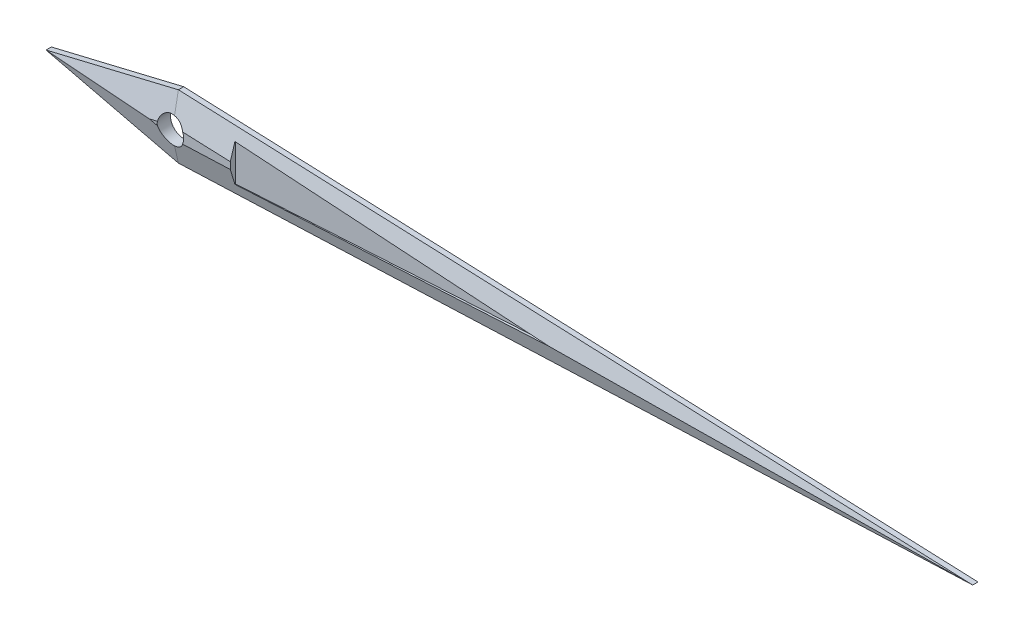
ISO-10303-21;
HEADER;
FILE_DESCRIPTION(('STEP AP214'),'2;1');
FILE_NAME('part.step','',(''),(''),'','','');
FILE_SCHEMA(('AUTOMOTIVE_DESIGN { 1 0 10303 214 1 1 1 1 }'));
ENDSEC;
DATA;
#1=APPLICATION_CONTEXT('core data for automotive mechanical design processes');
#2=APPLICATION_PROTOCOL_DEFINITION('international standard','automotive_design',2000,#1);
#3=PRODUCT_CONTEXT('',#1,'mechanical');
#4=PRODUCT('Part','Part','',(#3));
#5=PRODUCT_RELATED_PRODUCT_CATEGORY('part','',(#4));
#6=PRODUCT_DEFINITION_FORMATION('','',#4);
#7=PRODUCT_DEFINITION_CONTEXT('part definition',#1,'design');
#8=PRODUCT_DEFINITION('design','',#6,#7);
#9=PRODUCT_DEFINITION_SHAPE('','',#8);
#10=(LENGTH_UNIT() NAMED_UNIT(*) SI_UNIT(.MILLI.,.METRE.));
#11=(NAMED_UNIT(*) PLANE_ANGLE_UNIT() SI_UNIT($,.RADIAN.));
#12=(NAMED_UNIT(*) SI_UNIT($,.STERADIAN.) SOLID_ANGLE_UNIT());
#13=UNCERTAINTY_MEASURE_WITH_UNIT(LENGTH_MEASURE(1.E-05),#10,'distance_accuracy_value','');
#14=(GEOMETRIC_REPRESENTATION_CONTEXT(3) GLOBAL_UNCERTAINTY_ASSIGNED_CONTEXT((#13)) GLOBAL_UNIT_ASSIGNED_CONTEXT((#10,
#11,#12)) REPRESENTATION_CONTEXT('',''));
#15=CARTESIAN_POINT('',(0.,0.,0.));
#16=DIRECTION('',(0.,0.,1.));
#17=DIRECTION('',(1.,0.,0.));
#18=AXIS2_PLACEMENT_3D('',#15,#16,#17);
#19=CARTESIAN_POINT('',(-2.5,0.,0.25));
#20=DIRECTION('',(0.,0.,-1.));
#21=DIRECTION('',(-1.,0.,0.));
#22=AXIS2_PLACEMENT_3D('',#19,#20,#21);
#23=PLANE('',#22);
#24=CARTESIAN_POINT('',(0.,0.,0.25));
#25=DIRECTION('',(0.,0.,1.));
#26=DIRECTION('',(1.,0.,0.));
#27=AXIS2_PLACEMENT_3D('',#24,#25,#26);
#28=CIRCLE('',#27,0.25);
#29=CARTESIAN_POINT('',(-0.247384584370099,0.0360675396448611,0.25));
#30=VERTEX_POINT('',#29);
#31=CARTESIAN_POINT('',(-0.247384584370099,-0.0360675396448611,0.25));
#32=VERTEX_POINT('',#31);
#33=EDGE_CURVE('E151',#30,#32,#28,.T.);
#34=ORIENTED_EDGE('',*,*,#33,.F.);
#35=DIRECTION('',(-0.972387301980517,-0.233372952475324,0.));
#36=VECTOR('',#35,1.);
#37=CARTESIAN_POINT('',(-2.3855007200969,-0.477080332929572,0.25));
#38=LINE('',#37,#36);
#39=CARTESIAN_POINT('',(-0.39766599955702,0.,0.25));
#40=VERTEX_POINT('',#39);
#41=EDGE_CURVE('E194',#30,#40,#38,.T.);
#42=ORIENTED_EDGE('',*,*,#41,.T.);
#43=DIRECTION('',(0.972387301980517,-0.233372952475324,0.));
#44=VECTOR('',#43,1.);
#45=CARTESIAN_POINT('',(-2.3855007200969,0.477080332929572,0.25));
#46=LINE('',#45,#44);
#47=EDGE_CURVE('E191',#40,#32,#46,.T.);
#48=ORIENTED_EDGE('',*,*,#47,.T.);
#49=EDGE_LOOP('',(#34,#42,#48));
#50=FACE_BOUND('',#49,.T.);
#51=ADVANCED_FACE('F33',(#50),#23,.F.);
#52=CARTESIAN_POINT('',(-2.5,0.,0.25));
#53=DIRECTION('',(0.233372952475324,0.972387301980517,0.));
#54=DIRECTION('',(-0.972387301980517,0.233372952475324,0.));
#55=AXIS2_PLACEMENT_3D('',#52,#53,#54);
#56=PLANE('',#55);
#57=DIRECTION('',(0.,0.,-1.));
#58=VECTOR('',#57,1.);
#59=CARTESIAN_POINT('',(0.,-0.6,0.25));
#60=LINE('',#59,#58);
#61=CARTESIAN_POINT('',(0.,-0.6,0.0999999999999992));
#62=VERTEX_POINT('',#61);
#63=CARTESIAN_POINT('',(0.,-0.6,0.));
#64=VERTEX_POINT('',#63);
#65=EDGE_CURVE('E173',#62,#64,#60,.T.);
#66=ORIENTED_EDGE('',*,*,#65,.F.);
#67=DIRECTION('',(-0.972387301980517,0.233372952475324,0.));
#68=VECTOR('',#67,1.);
#69=CARTESIAN_POINT('',(-2.5,0.,0.0999999999999966));
#70=LINE('',#69,#68);
#71=CARTESIAN_POINT('',(-2.5,0.,0.0999999999999965));
#72=VERTEX_POINT('',#71);
#73=EDGE_CURVE('E206',#62,#72,#70,.T.);
#74=ORIENTED_EDGE('',*,*,#73,.T.);
#75=DIRECTION('',(0.,0.,-1.));
#76=VECTOR('',#75,1.);
#77=CARTESIAN_POINT('',(-2.5,0.,0.25));
#78=LINE('',#77,#76);
#79=CARTESIAN_POINT('',(-2.5,0.,0.));
#80=VERTEX_POINT('',#79);
#81=EDGE_CURVE('E167',#72,#80,#78,.T.);
#82=ORIENTED_EDGE('',*,*,#81,.T.);
#83=DIRECTION('',(0.972387301980517,-0.233372952475324,0.));
#84=VECTOR('',#83,1.);
#85=CARTESIAN_POINT('',(-2.5,0.,0.));
#86=LINE('',#85,#84);
#87=EDGE_CURVE('E150',#80,#64,#86,.T.);
#88=ORIENTED_EDGE('',*,*,#87,.T.);
#89=EDGE_LOOP('',(#66,#74,#82,#88));
#90=FACE_BOUND('',#89,.T.);
#91=ADVANCED_FACE('F239',(#90),#56,.F.);
#92=CARTESIAN_POINT('',(0.,-0.6,0.25));
#93=DIRECTION('',(-0.0399680383488716,0.999200958721789,0.));
#94=DIRECTION('',(-0.999200958721789,-0.0399680383488716,0.));
#95=AXIS2_PLACEMENT_3D('',#92,#93,#94);
#96=PLANE('',#95);
#97=DIRECTION('',(0.,0.,-1.));
#98=VECTOR('',#97,1.);
#99=CARTESIAN_POINT('',(15.,0.,0.25));
#100=LINE('',#99,#98);
#101=CARTESIAN_POINT('',(15.,0.,0.0999999999999992));
#102=VERTEX_POINT('',#101);
#103=CARTESIAN_POINT('',(15.,0.,0.));
#104=VERTEX_POINT('',#103);
#105=EDGE_CURVE('E171',#102,#104,#100,.T.);
#106=ORIENTED_EDGE('',*,*,#105,.F.);
#107=DIRECTION('',(-0.999200958721789,-0.0399680383488716,0.));
#108=VECTOR('',#107,1.);
#109=CARTESIAN_POINT('',(0.,-0.6,0.0999999999999991));
#110=LINE('',#109,#108);
#111=EDGE_CURVE('E188',#102,#62,#110,.T.);
#112=ORIENTED_EDGE('',*,*,#111,.T.);
#113=ORIENTED_EDGE('',*,*,#65,.T.);
#114=DIRECTION('',(0.999200958721789,0.0399680383488716,0.));
#115=VECTOR('',#114,1.);
#116=CARTESIAN_POINT('',(0.,-0.6,0.));
#117=LINE('',#116,#115);
#118=EDGE_CURVE('E158',#64,#104,#117,.T.);
#119=ORIENTED_EDGE('',*,*,#118,.T.);
#120=EDGE_LOOP('',(#106,#112,#113,#119));
#121=FACE_BOUND('',#120,.T.);
#122=ADVANCED_FACE('F235',(#121),#96,.F.);
#123=CARTESIAN_POINT('',(0.,0.6,0.25));
#124=DIRECTION('',(-0.0399680383488716,-0.999200958721789,0.));
#125=DIRECTION('',(0.999200958721789,-0.0399680383488716,0.));
#126=AXIS2_PLACEMENT_3D('',#123,#124,#125);
#127=PLANE('',#126);
#128=DIRECTION('',(0.,0.,-1.));
#129=VECTOR('',#128,1.);
#130=CARTESIAN_POINT('',(0.,0.6,0.25));
#131=LINE('',#130,#129);
#132=CARTESIAN_POINT('',(0.,0.6,0.0999999999999991));
#133=VERTEX_POINT('',#132);
#134=CARTESIAN_POINT('',(0.,0.6,0.));
#135=VERTEX_POINT('',#134);
#136=EDGE_CURVE('E169',#133,#135,#131,.T.);
#137=ORIENTED_EDGE('',*,*,#136,.F.);
#138=DIRECTION('',(0.999200958721789,-0.0399680383488716,0.));
#139=VECTOR('',#138,1.);
#140=CARTESIAN_POINT('',(0.,0.6,0.0999999999999991));
#141=LINE('',#140,#139);
#142=EDGE_CURVE('E185',#133,#102,#141,.T.);
#143=ORIENTED_EDGE('',*,*,#142,.T.);
#144=ORIENTED_EDGE('',*,*,#105,.T.);
#145=DIRECTION('',(-0.999200958721789,0.0399680383488716,0.));
#146=VECTOR('',#145,1.);
#147=CARTESIAN_POINT('',(0.,0.6,0.));
#148=LINE('',#147,#146);
#149=EDGE_CURVE('E161',#104,#135,#148,.T.);
#150=ORIENTED_EDGE('',*,*,#149,.T.);
#151=EDGE_LOOP('',(#137,#143,#144,#150));
#152=FACE_BOUND('',#151,.T.);
#153=ADVANCED_FACE('F253',(#152),#127,.F.);
#154=CARTESIAN_POINT('',(0.,0.6,0.25));
#155=DIRECTION('',(0.233372952475324,-0.972387301980517,0.));
#156=DIRECTION('',(0.972387301980517,0.233372952475324,0.));
#157=AXIS2_PLACEMENT_3D('',#154,#155,#156);
#158=PLANE('',#157);
#159=ORIENTED_EDGE('',*,*,#81,.F.);
#160=DIRECTION('',(0.972387301980517,0.233372952475324,0.));
#161=VECTOR('',#160,1.);
#162=CARTESIAN_POINT('',(0.,0.6,0.0999999999999965));
#163=LINE('',#162,#161);
#164=EDGE_CURVE('E197',#72,#133,#163,.T.);
#165=ORIENTED_EDGE('',*,*,#164,.T.);
#166=ORIENTED_EDGE('',*,*,#136,.T.);
#167=DIRECTION('',(-0.972387301980517,-0.233372952475324,0.));
#168=VECTOR('',#167,1.);
#169=CARTESIAN_POINT('',(0.,0.6,0.));
#170=LINE('',#169,#168);
#171=EDGE_CURVE('E164',#135,#80,#170,.T.);
#172=ORIENTED_EDGE('',*,*,#171,.T.);
#173=EDGE_LOOP('',(#159,#165,#166,#172));
#174=FACE_BOUND('',#173,.T.);
#175=ADVANCED_FACE('F251',(#174),#158,.F.);
#176=DIRECTION('',(0.999200958721789,0.0399680383488716,0.));
#177=VECTOR('',#176,1.);
#178=CARTESIAN_POINT('',(-2.49165416286787,-0.208645928303325,0.25));
#179=LINE('',#178,#177);
#180=CARTESIAN_POINT('',(0.22921103889957,-0.0998113202326271,0.25));
#181=VERTEX_POINT('',#180);
#182=CARTESIAN_POINT('',(1.13005781427215,-0.063777449217724,0.25));
#183=VERTEX_POINT('',#182);
#184=EDGE_CURVE('E175',#181,#183,#179,.T.);
#185=ORIENTED_EDGE('',*,*,#184,.T.);
#186=DIRECTION('',(0.,-1.,0.));
#187=VECTOR('',#186,1.);
#188=CARTESIAN_POINT('',(1.13005781427215,0.35,0.25));
#189=LINE('',#188,#187);
#190=CARTESIAN_POINT('',(1.13005781427215,0.063777449217724,0.25));
#191=VERTEX_POINT('',#190);
#192=EDGE_CURVE('E136',#191,#183,#189,.T.);
#193=ORIENTED_EDGE('',*,*,#192,.F.);
#194=DIRECTION('',(-0.999200958721789,0.0399680383488716,0.));
#195=VECTOR('',#194,1.);
#196=CARTESIAN_POINT('',(-2.49165416286787,0.208645928303325,0.25));
#197=LINE('',#196,#195);
#198=CARTESIAN_POINT('',(0.22921103889957,0.0998113202326271,0.25));
#199=VERTEX_POINT('',#198);
#200=EDGE_CURVE('E178',#191,#199,#197,.T.);
#201=ORIENTED_EDGE('',*,*,#200,.T.);
#202=EDGE_CURVE('E152',#181,#199,#28,.T.);
#203=ORIENTED_EDGE('',*,*,#202,.F.);
#204=EDGE_LOOP('',(#185,#193,#201,#203));
#205=FACE_BOUND('',#204,.T.);
#206=ADVANCED_FACE('F215',(#205),#23,.F.);
#207=CARTESIAN_POINT('',(-2.5,0.,0.));
#208=DIRECTION('',(0.,0.,-1.));
#209=DIRECTION('',(-1.,0.,0.));
#210=AXIS2_PLACEMENT_3D('',#207,#208,#209);
#211=PLANE('',#210);
#212=CARTESIAN_POINT('',(0.,0.,0.));
#213=DIRECTION('',(0.,0.,1.));
#214=DIRECTION('',(1.,0.,0.));
#215=AXIS2_PLACEMENT_3D('',#212,#213,#214);
#216=CIRCLE('',#215,0.25);
#217=CARTESIAN_POINT('',(0.25,0.,0.));
#218=VERTEX_POINT('',#217);
#219=EDGE_CURVE('E147',#218,#218,#216,.T.);
#220=ORIENTED_EDGE('',*,*,#219,.T.);
#221=EDGE_LOOP('',(#220));
#222=FACE_BOUND('',#221,.T.);
#223=ORIENTED_EDGE('',*,*,#87,.F.);
#224=ORIENTED_EDGE('',*,*,#171,.F.);
#225=ORIENTED_EDGE('',*,*,#149,.F.);
#226=ORIENTED_EDGE('',*,*,#118,.F.);
#227=EDGE_LOOP('',(#223,#224,#225,#226));
#228=FACE_BOUND('',#227,.T.);
#229=ADVANCED_FACE('F257',(#222,#228),#211,.T.);
#230=CARTESIAN_POINT('',(0.,0.,0.));
#231=DIRECTION('',(0.,0.,1.));
#232=DIRECTION('',(1.,0.,0.));
#233=AXIS2_PLACEMENT_3D('',#230,#231,#232);
#234=CYLINDRICAL_SURFACE('',#233,0.25);
#235=ORIENTED_EDGE('',*,*,#219,.F.);
#236=EDGE_LOOP('',(#235));
#237=FACE_BOUND('',#236,.T.);
#238=CARTESIAN_POINT('',(0.,0.,0.283291834014495));
#239=DIRECTION('',(-0.0116855235064833,-0.292138087662083,-0.956304755963035));
#240=DIRECTION('',(-0.0382216251595389,-0.955540628988472,0.292371704722738));
#241=AXIS2_PLACEMENT_3D('',#238,#239,#240);
#242=ELLIPSE('',#241,0.261422939121787,0.25);
#243=CARTESIAN_POINT('',(0.0345691851991523,0.247598407577001,0.207231473684364));
#244=VERTEX_POINT('',#243);
#245=EDGE_CURVE('E182',#199,#244,#242,.F.);
#246=ORIENTED_EDGE('',*,*,#245,.T.);
#247=CARTESIAN_POINT('',(0.,0.,0.278373179485746));
#248=DIRECTION('',(0.0682316479513881,-0.284298533130784,-0.956304755963036));
#249=DIRECTION('',(0.223175664365288,-0.929898601522034,0.292371704722734));
#250=AXIS2_PLACEMENT_3D('',#247,#248,#249);
#251=ELLIPSE('',#250,0.261422939121787,0.25);
#252=EDGE_CURVE('E202',#244,#30,#251,.F.);
#253=ORIENTED_EDGE('',*,*,#252,.T.);
#254=ORIENTED_EDGE('',*,*,#33,.T.);
#255=CARTESIAN_POINT('',(0.,0.,0.278373179485746));
#256=DIRECTION('',(0.0682316479513881,0.284298533130784,-0.956304755963036));
#257=DIRECTION('',(0.223175664365288,0.929898601522034,0.292371704722734));
#258=AXIS2_PLACEMENT_3D('',#255,#256,#257);
#259=ELLIPSE('',#258,0.261422939121787,0.25);
#260=CARTESIAN_POINT('',(0.0345691851991518,-0.247598407577001,0.207231473684364));
#261=VERTEX_POINT('',#260);
#262=EDGE_CURVE('E56',#32,#261,#259,.F.);
#263=ORIENTED_EDGE('',*,*,#262,.T.);
#264=CARTESIAN_POINT('',(0.,0.,0.283291834014495));
#265=DIRECTION('',(-0.0116855235064833,0.292138087662083,-0.956304755963035));
#266=DIRECTION('',(-0.0382216251595389,0.955540628988472,0.292371704722738));
#267=AXIS2_PLACEMENT_3D('',#264,#265,#266);
#268=ELLIPSE('',#267,0.261422939121787,0.25);
#269=EDGE_CURVE('E180',#261,#181,#268,.F.);
#270=ORIENTED_EDGE('',*,*,#269,.T.);
#271=ORIENTED_EDGE('',*,*,#202,.T.);
#272=EDGE_LOOP('',(#246,#253,#254,#263,#270,#271));
#273=FACE_BOUND('',#272,.T.);
#274=ADVANCED_FACE('F223',(#237,#273),#234,.F.);
#275=CARTESIAN_POINT('',(-2.49165416286787,-0.208645928303325,0.25));
#276=DIRECTION('',(-0.0116855235064833,0.292138087662083,-0.956304755963035));
#277=DIRECTION('',(0.,0.956370055055761,0.292158035646192));
#278=AXIS2_PLACEMENT_3D('',#275,#276,#277);
#279=PLANE('',#278);
#280=DIRECTION('',(-0.998272418954995,-0.0584813116002024,-0.00566689926353398));
#281=VECTOR('',#280,1.);
#282=CARTESIAN_POINT('',(-2.47040443854288,-0.560924143463824,0.142124139703543));
#283=LINE('',#282,#281);
#284=CARTESIAN_POINT('',(1.13005781427215,-0.35,0.162562906218016));
#285=VERTEX_POINT('',#284);
#286=CARTESIAN_POINT('',(7.10453644811043,0.,0.196478266321362));
#287=VERTEX_POINT('',#286);
#288=EDGE_CURVE('E11',#285,#287,#283,.F.);
#289=ORIENTED_EDGE('',*,*,#288,.F.);
#290=DIRECTION('',(0.,0.956370055055761,0.292158035646192));
#291=VECTOR('',#290,1.);
#292=CARTESIAN_POINT('',(1.13005781427215,-0.196280488364357,0.209522124903865));
#293=LINE('',#292,#291);
#294=EDGE_CURVE('E143',#183,#285,#293,.F.);
#295=ORIENTED_EDGE('',*,*,#294,.F.);
#296=ORIENTED_EDGE('',*,*,#184,.F.);
#297=ORIENTED_EDGE('',*,*,#269,.F.);
#298=DIRECTION('',(-0.0934368851166573,-0.952504576445504,-0.289835436670653));
#299=VECTOR('',#298,1.);
#300=CARTESIAN_POINT('',(0.0171390770106715,-0.425282603670863,0.153164356488434));
#301=LINE('',#300,#299);
#302=EDGE_CURVE('E204',#261,#62,#301,.T.);
#303=ORIENTED_EDGE('',*,*,#302,.T.);
#304=ORIENTED_EDGE('',*,*,#111,.F.);
#305=DIRECTION('',(-0.999925350811992,0.,0.0122185434285279));
#306=VECTOR('',#305,1.);
#307=CARTESIAN_POINT('',(-2.49087542947841,0.,0.313728975732545));
#308=LINE('',#307,#306);
#309=EDGE_CURVE('E155',#287,#102,#308,.F.);
#310=ORIENTED_EDGE('',*,*,#309,.F.);
#311=EDGE_LOOP('',(#289,#295,#296,#297,#303,#304,#310));
#312=FACE_BOUND('',#311,.T.);
#313=ADVANCED_FACE('F226',(#312),#279,.F.);
#314=CARTESIAN_POINT('',(-2.49165416286787,0.208645928303325,0.25));
#315=DIRECTION('',(-0.0116855235064833,-0.292138087662083,-0.956304755963035));
#316=DIRECTION('',(0.,0.956370055055761,-0.292158035646192));
#317=AXIS2_PLACEMENT_3D('',#314,#315,#316);
#318=PLANE('',#317);
#319=DIRECTION('',(0.998272418954995,-0.0584813116002024,0.00566689926353398));
#320=VECTOR('',#319,1.);
#321=CARTESIAN_POINT('',(-2.47040443854288,0.560924143463824,0.142124139703543));
#322=LINE('',#321,#320);
#323=CARTESIAN_POINT('',(1.13005781427215,0.35,0.162562906218016));
#324=VERTEX_POINT('',#323);
#325=EDGE_CURVE('E41',#287,#324,#322,.F.);
#326=ORIENTED_EDGE('',*,*,#325,.F.);
#327=ORIENTED_EDGE('',*,*,#309,.T.);
#328=ORIENTED_EDGE('',*,*,#142,.F.);
#329=DIRECTION('',(0.0934368851166573,-0.952504576445504,0.289835436670653));
#330=VECTOR('',#329,1.);
#331=CARTESIAN_POINT('',(0.0171390770106715,0.425282603670863,0.153164356488434));
#332=LINE('',#331,#330);
#333=EDGE_CURVE('E199',#133,#244,#332,.T.);
#334=ORIENTED_EDGE('',*,*,#333,.T.);
#335=ORIENTED_EDGE('',*,*,#245,.F.);
#336=ORIENTED_EDGE('',*,*,#200,.F.);
#337=DIRECTION('',(0.,0.956370055055761,-0.292158035646192));
#338=VECTOR('',#337,1.);
#339=CARTESIAN_POINT('',(1.13005781427215,0.196280488364357,0.209522124903865));
#340=LINE('',#339,#338);
#341=EDGE_CURVE('E208',#324,#191,#340,.F.);
#342=ORIENTED_EDGE('',*,*,#341,.F.);
#343=EDGE_LOOP('',(#326,#327,#328,#334,#335,#336,#342));
#344=FACE_BOUND('',#343,.T.);
#345=ADVANCED_FACE('F219',(#344),#318,.F.);
#346=CARTESIAN_POINT('',(-2.3855007200969,0.477080332929572,0.25));
#347=DIRECTION('',(0.0682316479513881,0.284298533130784,-0.956304755963036));
#348=DIRECTION('',(0.,0.958538624950168,0.284962636987099));
#349=AXIS2_PLACEMENT_3D('',#346,#347,#348);
#350=PLANE('',#349);
#351=ORIENTED_EDGE('',*,*,#262,.F.);
#352=ORIENTED_EDGE('',*,*,#47,.F.);
#353=DIRECTION('',(-0.997464317943384,0.,-0.0711683527260582));
#354=VECTOR('',#353,1.);
#355=CARTESIAN_POINT('',(-2.37543246758021,0.,0.108887802727361));
#356=LINE('',#355,#354);
#357=EDGE_CURVE('E146',#72,#40,#356,.F.);
#358=ORIENTED_EDGE('',*,*,#357,.F.);
#359=ORIENTED_EDGE('',*,*,#73,.F.);
#360=ORIENTED_EDGE('',*,*,#302,.F.);
#361=EDGE_LOOP('',(#351,#352,#358,#359,#360));
#362=FACE_BOUND('',#361,.T.);
#363=ADVANCED_FACE('F35',(#362),#350,.F.);
#364=CARTESIAN_POINT('',(-2.3855007200969,-0.477080332929572,0.25));
#365=DIRECTION('',(0.0682316479513881,-0.284298533130784,-0.956304755963036));
#366=DIRECTION('',(0.,0.958538624950168,-0.284962636987099));
#367=AXIS2_PLACEMENT_3D('',#364,#365,#366);
#368=PLANE('',#367);
#369=ORIENTED_EDGE('',*,*,#333,.F.);
#370=ORIENTED_EDGE('',*,*,#164,.F.);
#371=ORIENTED_EDGE('',*,*,#357,.T.);
#372=ORIENTED_EDGE('',*,*,#41,.F.);
#373=ORIENTED_EDGE('',*,*,#252,.F.);
#374=EDGE_LOOP('',(#369,#370,#371,#372,#373));
#375=FACE_BOUND('',#374,.T.);
#376=ADVANCED_FACE('F248',(#375),#368,.F.);
#377=CARTESIAN_POINT('',(7.10453644811043,0.,0.15));
#378=DIRECTION('',(0.0584822506498499,0.998288448475153,0.));
#379=DIRECTION('',(-0.998288448475153,0.0584822506498499,0.));
#380=AXIS2_PLACEMENT_3D('',#377,#378,#379);
#381=PLANE('',#380);
#382=ORIENTED_EDGE('',*,*,#325,.T.);
#383=DIRECTION('',(0.,0.,1.));
#384=VECTOR('',#383,1.);
#385=CARTESIAN_POINT('',(1.13005781427215,0.35,0.15));
#386=LINE('',#385,#384);
#387=CARTESIAN_POINT('',(1.13005781427215,0.35,0.15));
#388=VERTEX_POINT('',#387);
#389=EDGE_CURVE('E48',#388,#324,#386,.T.);
#390=ORIENTED_EDGE('',*,*,#389,.F.);
#391=DIRECTION('',(-0.998288448475153,0.0584822506498499,0.));
#392=VECTOR('',#391,1.);
#393=CARTESIAN_POINT('',(7.10453644811043,0.,0.15));
#394=LINE('',#393,#392);
#395=CARTESIAN_POINT('',(7.10453644811043,0.,0.15));
#396=VERTEX_POINT('',#395);
#397=EDGE_CURVE('E121',#396,#388,#394,.T.);
#398=ORIENTED_EDGE('',*,*,#397,.F.);
#399=DIRECTION('',(0.,0.,1.));
#400=VECTOR('',#399,1.);
#401=CARTESIAN_POINT('',(7.10453644811043,0.,0.15));
#402=LINE('',#401,#400);
#403=EDGE_CURVE('E141',#396,#287,#402,.T.);
#404=ORIENTED_EDGE('',*,*,#403,.T.);
#405=EDGE_LOOP('',(#382,#390,#398,#404));
#406=FACE_BOUND('',#405,.T.);
#407=ADVANCED_FACE('F118',(#406),#381,.F.);
#408=CARTESIAN_POINT('',(1.13005781427215,-0.35,0.15));
#409=DIRECTION('',(0.0584822506498499,-0.998288448475153,0.));
#410=DIRECTION('',(0.998288448475153,0.0584822506498499,0.));
#411=AXIS2_PLACEMENT_3D('',#408,#409,#410);
#412=PLANE('',#411);
#413=ORIENTED_EDGE('',*,*,#288,.T.);
#414=ORIENTED_EDGE('',*,*,#403,.F.);
#415=DIRECTION('',(0.998288448475153,0.0584822506498499,0.));
#416=VECTOR('',#415,1.);
#417=CARTESIAN_POINT('',(1.13005781427215,-0.35,0.15));
#418=LINE('',#417,#416);
#419=CARTESIAN_POINT('',(1.13005781427215,-0.35,0.15));
#420=VERTEX_POINT('',#419);
#421=EDGE_CURVE('E126',#420,#396,#418,.T.);
#422=ORIENTED_EDGE('',*,*,#421,.F.);
#423=DIRECTION('',(0.,0.,1.));
#424=VECTOR('',#423,1.);
#425=CARTESIAN_POINT('',(1.13005781427215,-0.35,0.15));
#426=LINE('',#425,#424);
#427=EDGE_CURVE('E125',#420,#285,#426,.T.);
#428=ORIENTED_EDGE('',*,*,#427,.T.);
#429=EDGE_LOOP('',(#413,#414,#422,#428));
#430=FACE_BOUND('',#429,.T.);
#431=ADVANCED_FACE('F230',(#430),#412,.F.);
#432=CARTESIAN_POINT('',(1.13005781427215,0.35,0.15));
#433=DIRECTION('',(-1.,0.,0.));
#434=DIRECTION('',(0.,0.,1.));
#435=AXIS2_PLACEMENT_3D('',#432,#433,#434);
#436=PLANE('',#435);
#437=ORIENTED_EDGE('',*,*,#294,.T.);
#438=ORIENTED_EDGE('',*,*,#427,.F.);
#439=DIRECTION('',(0.,-1.,0.));
#440=VECTOR('',#439,1.);
#441=CARTESIAN_POINT('',(1.13005781427215,0.35,0.15));
#442=LINE('',#441,#440);
#443=EDGE_CURVE('E129',#388,#420,#442,.T.);
#444=ORIENTED_EDGE('',*,*,#443,.F.);
#445=ORIENTED_EDGE('',*,*,#389,.T.);
#446=ORIENTED_EDGE('',*,*,#341,.T.);
#447=ORIENTED_EDGE('',*,*,#192,.T.);
#448=EDGE_LOOP('',(#437,#438,#444,#445,#446,#447));
#449=FACE_BOUND('',#448,.T.);
#450=ADVANCED_FACE('F130',(#449),#436,.F.);
#451=CARTESIAN_POINT('',(1.13005781427215,0.35,0.15));
#452=DIRECTION('',(0.,0.,1.));
#453=DIRECTION('',(1.,0.,0.));
#454=AXIS2_PLACEMENT_3D('',#451,#452,#453);
#455=PLANE('',#454);
#456=ORIENTED_EDGE('',*,*,#397,.T.);
#457=ORIENTED_EDGE('',*,*,#443,.T.);
#458=ORIENTED_EDGE('',*,*,#421,.T.);
#459=EDGE_LOOP('',(#456,#457,#458));
#460=FACE_BOUND('',#459,.T.);
#461=ADVANCED_FACE('F135',(#460),#455,.T.);
#462=CLOSED_SHELL('',(#51,#91,#122,#153,#175,#206,#229,#274,#313,#345,#363,#376,#407,#431,#450,#461));
#463=MANIFOLD_SOLID_BREP('B2',#462);
#464=ADVANCED_BREP_SHAPE_REPRESENTATION('',(#18,#463),#14);
#465=SHAPE_DEFINITION_REPRESENTATION(#9,#464);
ENDSEC;
END-ISO-10303-21;
